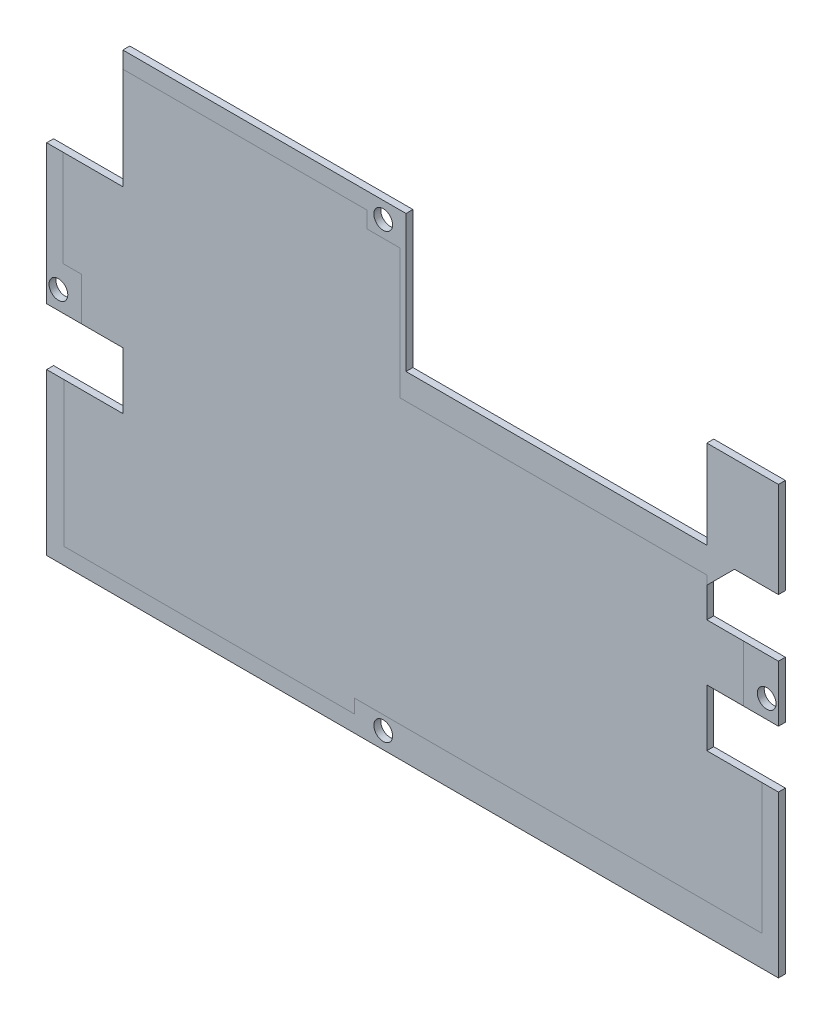
ISO-10303-21;
HEADER;
FILE_DESCRIPTION(('STEP AP214'),'2;1');
FILE_NAME('part.step','',(''),(''),'','','');
FILE_SCHEMA(('AUTOMOTIVE_DESIGN { 1 0 10303 214 1 1 1 1 }'));
ENDSEC;
DATA;
#1=APPLICATION_CONTEXT('core data for automotive mechanical design processes');
#2=APPLICATION_PROTOCOL_DEFINITION('international standard','automotive_design',2000,#1);
#3=PRODUCT_CONTEXT('',#1,'mechanical');
#4=PRODUCT('Part','Part','',(#3));
#5=PRODUCT_RELATED_PRODUCT_CATEGORY('part','',(#4));
#6=PRODUCT_DEFINITION_FORMATION('','',#4);
#7=PRODUCT_DEFINITION_CONTEXT('part definition',#1,'design');
#8=PRODUCT_DEFINITION('design','',#6,#7);
#9=PRODUCT_DEFINITION_SHAPE('','',#8);
#10=(LENGTH_UNIT() NAMED_UNIT(*) SI_UNIT(.MILLI.,.METRE.));
#11=(NAMED_UNIT(*) PLANE_ANGLE_UNIT() SI_UNIT($,.RADIAN.));
#12=(NAMED_UNIT(*) SI_UNIT($,.STERADIAN.) SOLID_ANGLE_UNIT());
#13=UNCERTAINTY_MEASURE_WITH_UNIT(LENGTH_MEASURE(1.E-05),#10,'distance_accuracy_value','');
#14=(GEOMETRIC_REPRESENTATION_CONTEXT(3) GLOBAL_UNCERTAINTY_ASSIGNED_CONTEXT((#13)) GLOBAL_UNIT_ASSIGNED_CONTEXT((#10,
#11,#12)) REPRESENTATION_CONTEXT('',''));
#15=CARTESIAN_POINT('',(0.,0.,0.));
#16=DIRECTION('',(0.,0.,1.));
#17=DIRECTION('',(1.,0.,0.));
#18=AXIS2_PLACEMENT_3D('',#15,#16,#17);
#19=CARTESIAN_POINT('',(0.,2.77555756156289E-13,1.58750000000001));
#20=DIRECTION('',(0.,0.,1.));
#21=DIRECTION('',(1.,0.,0.));
#22=AXIS2_PLACEMENT_3D('',#19,#20,#21);
#23=PLANE('',#22);
#24=CARTESIAN_POINT('',(-56.162,-40.8939999999999,1.58750000000001));
#25=DIRECTION('',(0.,0.,-1.));
#26=DIRECTION('',(-1.,0.,0.));
#27=AXIS2_PLACEMENT_3D('',#24,#25,#26);
#28=CIRCLE('',#27,2.15265);
#29=CARTESIAN_POINT('',(-58.31465,-40.8939999999999,1.58750000000001));
#30=VERTEX_POINT('',#29);
#31=EDGE_CURVE('E570',#30,#30,#28,.T.);
#32=ORIENTED_EDGE('',*,*,#31,.T.);
#33=EDGE_LOOP('',(#32));
#34=FACE_BOUND('',#33,.T.);
#35=DIRECTION('',(-1.,0.,0.));
#36=VECTOR('',#35,1.);
#37=CARTESIAN_POINT('',(0.,-35.2241419424065,1.58750000000001));
#38=LINE('',#37,#36);
#39=CARTESIAN_POINT('',(-50.8980756529792,-35.2241419424065,1.58750000000001));
#40=VERTEX_POINT('',#39);
#41=CARTESIAN_POINT('',(-55.1232721065638,-35.2241419424065,1.58750000000001));
#42=VERTEX_POINT('',#41);
#43=EDGE_CURVE('E47',#40,#42,#38,.T.);
#44=ORIENTED_EDGE('',*,*,#43,.T.);
#45=DIRECTION('',(0.,1.,0.));
#46=VECTOR('',#45,1.);
#47=CARTESIAN_POINT('',(-55.1232721065638,3.05311331771918E-13,1.58750000000001));
#48=LINE('',#47,#46);
#49=CARTESIAN_POINT('',(-55.1232721065638,-13.0804999999998,1.58749999999987));
#50=VERTEX_POINT('',#49);
#51=EDGE_CURVE('E11',#42,#50,#48,.T.);
#52=ORIENTED_EDGE('',*,*,#51,.T.);
#53=DIRECTION('',(1.,0.,0.));
#54=VECTOR('',#53,1.);
#55=CARTESIAN_POINT('',(-58.86075,-13.0804999999998,1.58749999999987));
#56=LINE('',#55,#54);
#57=CARTESIAN_POINT('',(-58.86075,-13.0804999999998,1.58749999999987));
#58=VERTEX_POINT('',#57);
#59=EDGE_CURVE('E253',#58,#50,#56,.T.);
#60=ORIENTED_EDGE('',*,*,#59,.F.);
#61=DIRECTION('',(0.,-1.,0.));
#62=VECTOR('',#61,1.);
#63=CARTESIAN_POINT('',(-58.86075,-13.0804999999998,1.58749999999987));
#64=LINE('',#63,#62);
#65=CARTESIAN_POINT('',(-58.86075,-45.0854999999999,1.58749999999997));
#66=VERTEX_POINT('',#65);
#67=EDGE_CURVE('E340',#58,#66,#64,.T.);
#68=ORIENTED_EDGE('',*,*,#67,.T.);
#69=DIRECTION('',(1.,0.,0.));
#70=VECTOR('',#69,1.);
#71=CARTESIAN_POINT('',(-58.86075,-45.0854999999999,1.58749999999997));
#72=LINE('',#71,#70);
#73=CARTESIAN_POINT('',(-50.8980756529792,-45.0854999999999,1.58749999999997));
#74=VERTEX_POINT('',#73);
#75=EDGE_CURVE('E330',#66,#74,#72,.T.);
#76=ORIENTED_EDGE('',*,*,#75,.T.);
#77=DIRECTION('',(0.,1.,0.));
#78=VECTOR('',#77,1.);
#79=CARTESIAN_POINT('',(-50.8980756529792,2.77555756156289E-13,1.58750000000001));
#80=LINE('',#79,#78);
#81=EDGE_CURVE('E322',#74,#40,#80,.T.);
#82=ORIENTED_EDGE('',*,*,#81,.T.);
#83=EDGE_LOOP('',(#44,#52,#60,#68,#76,#82));
#84=FACE_BOUND('',#83,.T.);
#85=ADVANCED_FACE('F38',(#34,#84),#23,.T.);
#86=CARTESIAN_POINT('',(18.387,-91.3129999999999,1.58750000000001));
#87=DIRECTION('',(0.,0.,-1.));
#88=DIRECTION('',(-1.,0.,0.));
#89=AXIS2_PLACEMENT_3D('',#86,#87,#88);
#90=CIRCLE('',#89,2.15265);
#91=CARTESIAN_POINT('',(16.23435,-91.3129999999999,1.58750000000001));
#92=VERTEX_POINT('',#91);
#93=EDGE_CURVE('E404',#92,#92,#90,.T.);
#94=ORIENTED_EDGE('',*,*,#93,.T.);
#95=EDGE_LOOP('',(#94));
#96=FACE_BOUND('',#95,.T.);
#97=DIRECTION('',(-1.,0.,0.));
#98=VECTOR('',#97,1.);
#99=CARTESIAN_POINT('',(0.,-91.3130000000001,1.58750000000001));
#100=LINE('',#99,#98);
#101=CARTESIAN_POINT('',(11.78935,-91.3130000000001,1.58750000000001));
#102=VERTEX_POINT('',#101);
#103=CARTESIAN_POINT('',(-54.9021052088237,-91.3130000000001,1.58750000000001));
#104=VERTEX_POINT('',#103);
#105=EDGE_CURVE('E315',#102,#104,#100,.T.);
#106=ORIENTED_EDGE('',*,*,#105,.T.);
#107=DIRECTION('',(0.,1.,0.));
#108=VECTOR('',#107,1.);
#109=CARTESIAN_POINT('',(-54.9021052088237,2.77555756156289E-13,1.58750000000001));
#110=LINE('',#109,#108);
#111=CARTESIAN_POINT('',(-54.9021052088237,-58.1654999999999,1.58749999999993));
#112=VERTEX_POINT('',#111);
#113=EDGE_CURVE('E319',#104,#112,#110,.T.);
#114=ORIENTED_EDGE('',*,*,#113,.T.);
#115=DIRECTION('',(-1.,0.,0.));
#116=VECTOR('',#115,1.);
#117=CARTESIAN_POINT('',(-41.367,-58.1654999999999,1.58749999999993));
#118=LINE('',#117,#116);
#119=CARTESIAN_POINT('',(-58.8607499999999,-58.1654999999999,1.58749999999993));
#120=VERTEX_POINT('',#119);
#121=EDGE_CURVE('E346',#112,#120,#118,.T.);
#122=ORIENTED_EDGE('',*,*,#121,.T.);
#123=DIRECTION('',(0.,1.,0.));
#124=VECTOR('',#123,1.);
#125=CARTESIAN_POINT('',(-58.8607499999999,-95.1229999999999,1.58749999999999));
#126=LINE('',#125,#124);
#127=CARTESIAN_POINT('',(-58.8607499999999,-95.1229999999999,1.58749999999999));
#128=VERTEX_POINT('',#127);
#129=EDGE_CURVE('E350',#128,#120,#126,.T.);
#130=ORIENTED_EDGE('',*,*,#129,.F.);
#131=DIRECTION('',(-1.,0.,0.));
#132=VECTOR('',#131,1.);
#133=CARTESIAN_POINT('',(-38.0289667682287,-95.1229999999999,1.58749999999999));
#134=LINE('',#133,#132);
#135=CARTESIAN_POINT('',(109.09675,-95.1229999999999,1.58749999999999));
#136=VERTEX_POINT('',#135);
#137=EDGE_CURVE('E353',#136,#128,#134,.T.);
#138=ORIENTED_EDGE('',*,*,#137,.F.);
#139=DIRECTION('',(0.,1.,0.));
#140=VECTOR('',#139,1.);
#141=CARTESIAN_POINT('',(109.09675,-95.1229999999999,1.58749999999999));
#142=LINE('',#141,#140);
#143=CARTESIAN_POINT('',(109.09675,-58.1654999999996,1.58749999999993));
#144=VERTEX_POINT('',#143);
#145=EDGE_CURVE('E356',#136,#144,#142,.T.);
#146=ORIENTED_EDGE('',*,*,#145,.T.);
#147=DIRECTION('',(1.,0.,0.));
#148=VECTOR('',#147,1.);
#149=CARTESIAN_POINT('',(92.658,-58.1654999999996,1.58749999999993));
#150=LINE('',#149,#148);
#151=CARTESIAN_POINT('',(105.324493125114,-58.1654999999996,1.58749999999993));
#152=VERTEX_POINT('',#151);
#153=EDGE_CURVE('E359',#152,#144,#150,.T.);
#154=ORIENTED_EDGE('',*,*,#153,.F.);
#155=DIRECTION('',(-0.00125925749234109,-0.99999920713497,0.));
#156=VECTOR('',#155,1.);
#157=CARTESIAN_POINT('',(105.397571392563,-0.132722786681611,1.58750000000001));
#158=LINE('',#157,#156);
#159=CARTESIAN_POINT('',(105.28675,-88.1380000000001,1.58750000000001));
#160=VERTEX_POINT('',#159);
#161=EDGE_CURVE('E303',#152,#160,#158,.T.);
#162=ORIENTED_EDGE('',*,*,#161,.T.);
#163=DIRECTION('',(-1.,0.,0.));
#164=VECTOR('',#163,1.);
#165=CARTESIAN_POINT('',(0.,-88.138,1.58750000000001));
#166=LINE('',#165,#164);
#167=CARTESIAN_POINT('',(11.78935,-88.138,1.58750000000001));
#168=VERTEX_POINT('',#167);
#169=EDGE_CURVE('E307',#160,#168,#166,.T.);
#170=ORIENTED_EDGE('',*,*,#169,.T.);
#171=DIRECTION('',(0.,-1.,0.));
#172=VECTOR('',#171,1.);
#173=CARTESIAN_POINT('',(11.7893499999999,2.77555756156289E-13,1.58750000000001));
#174=LINE('',#173,#172);
#175=EDGE_CURVE('E311',#168,#102,#174,.T.);
#176=ORIENTED_EDGE('',*,*,#175,.T.);
#177=EDGE_LOOP('',(#106,#114,#122,#130,#138,#146,#154,#162,#170,#176));
#178=FACE_BOUND('',#177,.T.);
#179=ADVANCED_FACE('F523',(#96,#178),#23,.T.);
#180=CARTESIAN_POINT('',(106.398,-40.8939999999999,1.58750000000001));
#181=DIRECTION('',(0.,0.,-1.));
#182=DIRECTION('',(-1.,0.,0.));
#183=AXIS2_PLACEMENT_3D('',#180,#181,#182);
#184=CIRCLE('',#183,2.15264999999999);
#185=CARTESIAN_POINT('',(104.24535,-40.8939999999999,1.58750000000001));
#186=VERTEX_POINT('',#185);
#187=EDGE_CURVE('E582',#186,#186,#184,.T.);
#188=ORIENTED_EDGE('',*,*,#187,.T.);
#189=EDGE_LOOP('',(#188));
#190=FACE_BOUND('',#189,.T.);
#191=DIRECTION('',(0.,-1.,0.));
#192=VECTOR('',#191,1.);
#193=CARTESIAN_POINT('',(101.059888188257,2.77555756156289E-13,1.58750000000001));
#194=LINE('',#193,#192);
#195=CARTESIAN_POINT('',(101.059888188257,-32.150898303399,1.58749999999999));
#196=VERTEX_POINT('',#195);
#197=CARTESIAN_POINT('',(101.059888188257,-45.0384607081338,1.58749999999999));
#198=VERTEX_POINT('',#197);
#199=EDGE_CURVE('E296',#196,#198,#194,.T.);
#200=ORIENTED_EDGE('',*,*,#199,.T.);
#201=DIRECTION('',(-0.999984327887164,-0.00559856946518869,0.));
#202=VECTOR('',#201,1.);
#203=CARTESIAN_POINT('',(0.255314618261396,-45.6028309605485,1.58750000000001));
#204=LINE('',#203,#202);
#205=CARTESIAN_POINT('',(92.658,-45.0854999999996,1.58749999999997));
#206=VERTEX_POINT('',#205);
#207=EDGE_CURVE('E300',#198,#206,#204,.T.);
#208=ORIENTED_EDGE('',*,*,#207,.T.);
#209=DIRECTION('',(1.,0.,0.));
#210=VECTOR('',#209,1.);
#211=CARTESIAN_POINT('',(92.658,-45.0854999999996,1.58749999999997));
#212=LINE('',#211,#210);
#213=CARTESIAN_POINT('',(109.09675,-45.0854999999996,1.58749999999997));
#214=VERTEX_POINT('',#213);
#215=EDGE_CURVE('E366',#206,#214,#212,.T.);
#216=ORIENTED_EDGE('',*,*,#215,.T.);
#217=DIRECTION('',(0.,-1.,0.));
#218=VECTOR('',#217,1.);
#219=CARTESIAN_POINT('',(109.09675,-32.150898303399,1.58749999999999));
#220=LINE('',#219,#218);
#221=CARTESIAN_POINT('',(109.09675,-32.150898303399,1.58749999999999));
#222=VERTEX_POINT('',#221);
#223=EDGE_CURVE('E368',#222,#214,#220,.T.);
#224=ORIENTED_EDGE('',*,*,#223,.F.);
#225=DIRECTION('',(1.,0.,0.));
#226=VECTOR('',#225,1.);
#227=CARTESIAN_POINT('',(92.658,-32.150898303399,1.58749999999999));
#228=LINE('',#227,#226);
#229=EDGE_CURVE('E371',#196,#222,#228,.T.);
#230=ORIENTED_EDGE('',*,*,#229,.F.);
#231=EDGE_LOOP('',(#200,#208,#216,#224,#230));
#232=FACE_BOUND('',#231,.T.);
#233=ADVANCED_FACE('F543',(#190,#232),#23,.T.);
#234=CARTESIAN_POINT('',(18.387,10.2870000000002,1.58749999999987));
#235=DIRECTION('',(0.,0.,-1.));
#236=DIRECTION('',(-1.,0.,0.));
#237=AXIS2_PLACEMENT_3D('',#234,#235,#236);
#238=CIRCLE('',#237,2.15265);
#239=CARTESIAN_POINT('',(16.23435,10.2870000000002,1.58749999999987));
#240=VERTEX_POINT('',#239);
#241=EDGE_CURVE('E576',#240,#240,#238,.T.);
#242=ORIENTED_EDGE('',*,*,#241,.T.);
#243=EDGE_LOOP('',(#242));
#244=FACE_BOUND('',#243,.T.);
#245=DIRECTION('',(1.,0.,0.));
#246=VECTOR('',#245,1.);
#247=CARTESIAN_POINT('',(0.,-23.2430024525534,1.58750000000001));
#248=LINE('',#247,#246);
#249=CARTESIAN_POINT('',(22.276438833382,-23.2430024525534,1.58750000000001));
#250=VERTEX_POINT('',#249);
#251=CARTESIAN_POINT('',(92.7226000847606,-23.2430024525534,1.58750000000001));
#252=VERTEX_POINT('',#251);
#253=EDGE_CURVE('E289',#250,#252,#248,.T.);
#254=ORIENTED_EDGE('',*,*,#253,.T.);
#255=DIRECTION('',(-0.00725181201039535,-0.999973705265577,0.));
#256=VECTOR('',#255,1.);
#257=CARTESIAN_POINT('',(92.8862733688451,-0.673611505252414,1.58750000000001));
#258=LINE('',#257,#256);
#259=CARTESIAN_POINT('',(92.7082428987028,-25.2227571012969,1.58750000000001));
#260=VERTEX_POINT('',#259);
#261=EDGE_CURVE('E293',#252,#260,#258,.T.);
#262=ORIENTED_EDGE('',*,*,#261,.T.);
#263=DIRECTION('',(-0.707106781186551,-0.707106781186544,0.));
#264=VECTOR('',#263,1.);
#265=CARTESIAN_POINT('',(99.008,-18.9229999999997,1.58750000000001));
#266=LINE('',#265,#264);
#267=CARTESIAN_POINT('',(99.008,-18.9229999999997,1.58750000000001));
#268=VERTEX_POINT('',#267);
#269=EDGE_CURVE('E379',#268,#260,#266,.T.);
#270=ORIENTED_EDGE('',*,*,#269,.F.);
#271=DIRECTION('',(1.,0.,0.));
#272=VECTOR('',#271,1.);
#273=CARTESIAN_POINT('',(99.008,-18.9229999999997,1.58750000000001));
#274=LINE('',#273,#272);
#275=CARTESIAN_POINT('',(109.09675,-18.9229999999997,1.58750000000001));
#276=VERTEX_POINT('',#275);
#277=EDGE_CURVE('E382',#268,#276,#274,.T.);
#278=ORIENTED_EDGE('',*,*,#277,.T.);
#279=DIRECTION('',(0.,1.,0.));
#280=VECTOR('',#279,1.);
#281=CARTESIAN_POINT('',(109.09675,-18.9229999999997,1.58750000000001));
#282=LINE('',#281,#280);
#283=CARTESIAN_POINT('',(109.09675,2.9845000000005,1.58750000000001));
#284=VERTEX_POINT('',#283);
#285=EDGE_CURVE('E384',#276,#284,#282,.T.);
#286=ORIENTED_EDGE('',*,*,#285,.T.);
#287=DIRECTION('',(1.,0.,0.));
#288=VECTOR('',#287,1.);
#289=CARTESIAN_POINT('',(92.658,2.9845000000005,1.58750000000001));
#290=LINE('',#289,#288);
#291=CARTESIAN_POINT('',(92.658,2.9845000000005,1.58750000000001));
#292=VERTEX_POINT('',#291);
#293=EDGE_CURVE('E386',#292,#284,#290,.T.);
#294=ORIENTED_EDGE('',*,*,#293,.F.);
#295=DIRECTION('',(0.,1.,0.));
#296=VECTOR('',#295,1.);
#297=CARTESIAN_POINT('',(92.658,-17.3199999999997,1.58749999999999));
#298=LINE('',#297,#296);
#299=CARTESIAN_POINT('',(92.658,-17.3199999999997,1.58749999999999));
#300=VERTEX_POINT('',#299);
#301=EDGE_CURVE('E389',#300,#292,#298,.T.);
#302=ORIENTED_EDGE('',*,*,#301,.F.);
#303=DIRECTION('',(1.,0.,0.));
#304=VECTOR('',#303,1.);
#305=CARTESIAN_POINT('',(23.6180000000001,-17.3199999999997,1.58749999999999));
#306=LINE('',#305,#304);
#307=CARTESIAN_POINT('',(23.6180000000001,-17.3199999999997,1.58749999999999));
#308=VERTEX_POINT('',#307);
#309=EDGE_CURVE('E392',#308,#300,#306,.T.);
#310=ORIENTED_EDGE('',*,*,#309,.F.);
#311=DIRECTION('',(0.,-1.,0.));
#312=VECTOR('',#311,1.);
#313=CARTESIAN_POINT('',(23.618,14.0970000000002,1.58749999999999));
#314=LINE('',#313,#312);
#315=CARTESIAN_POINT('',(23.618,14.0970000000002,1.58749999999999));
#316=VERTEX_POINT('',#315);
#317=EDGE_CURVE('E395',#316,#308,#314,.T.);
#318=ORIENTED_EDGE('',*,*,#317,.F.);
#319=DIRECTION('',(1.,0.,0.));
#320=VECTOR('',#319,1.);
#321=CARTESIAN_POINT('',(6.66343681530298,14.0970000000002,1.58749999999999));
#322=LINE('',#321,#320);
#323=CARTESIAN_POINT('',(-41.367,14.0970000000002,1.58749999999999));
#324=VERTEX_POINT('',#323);
#325=EDGE_CURVE('E398',#324,#316,#322,.T.);
#326=ORIENTED_EDGE('',*,*,#325,.F.);
#327=DIRECTION('',(0.,-1.,0.));
#328=VECTOR('',#327,1.);
#329=CARTESIAN_POINT('',(-41.367,14.0970000000002,1.58749999999999));
#330=LINE('',#329,#328);
#331=CARTESIAN_POINT('',(-41.367,10.287,1.58749999999996));
#332=VERTEX_POINT('',#331);
#333=EDGE_CURVE('E254',#324,#332,#330,.T.);
#334=ORIENTED_EDGE('',*,*,#333,.T.);
#335=DIRECTION('',(1.,0.,0.));
#336=VECTOR('',#335,1.);
#337=CARTESIAN_POINT('',(0.,10.287,1.58749999999998));
#338=LINE('',#337,#336);
#339=CARTESIAN_POINT('',(14.6198067374962,10.287,1.58749999999998));
#340=VERTEX_POINT('',#339);
#341=EDGE_CURVE('E260',#332,#340,#338,.T.);
#342=ORIENTED_EDGE('',*,*,#341,.T.);
#343=DIRECTION('',(0.,-1.,0.));
#344=VECTOR('',#343,1.);
#345=CARTESIAN_POINT('',(14.6198067374962,2.77555756156289E-13,1.58750000000001));
#346=LINE('',#345,#344);
#347=CARTESIAN_POINT('',(14.6198067374962,6.54685000000002,1.5875));
#348=VERTEX_POINT('',#347);
#349=EDGE_CURVE('E272',#340,#348,#346,.T.);
#350=ORIENTED_EDGE('',*,*,#349,.T.);
#351=DIRECTION('',(1.,0.,0.));
#352=VECTOR('',#351,1.);
#353=CARTESIAN_POINT('',(0.,6.54685000000002,1.5875));
#354=LINE('',#353,#352);
#355=CARTESIAN_POINT('',(22.276438833382,6.54685000000002,1.5875));
#356=VERTEX_POINT('',#355);
#357=EDGE_CURVE('E281',#348,#356,#354,.T.);
#358=ORIENTED_EDGE('',*,*,#357,.T.);
#359=DIRECTION('',(0.,-1.,0.));
#360=VECTOR('',#359,1.);
#361=CARTESIAN_POINT('',(22.276438833382,2.77555756156289E-13,1.58750000000001));
#362=LINE('',#361,#360);
#363=EDGE_CURVE('E285',#356,#250,#362,.T.);
#364=ORIENTED_EDGE('',*,*,#363,.T.);
#365=EDGE_LOOP('',(#254,#262,#270,#278,#286,#294,#302,#310,#318,#326,#334,#342,#350,#358,#364));
#366=FACE_BOUND('',#365,.T.);
#367=ADVANCED_FACE('F561',(#244,#366),#23,.T.);
#368=CARTESIAN_POINT('',(0.,0.,0.));
#369=DIRECTION('',(0.,0.,1.));
#370=DIRECTION('',(1.,0.,0.));
#371=AXIS2_PLACEMENT_3D('',#368,#369,#370);
#372=PLANE('',#371);
#373=CARTESIAN_POINT('',(106.398,-40.8939999999999,0.));
#374=DIRECTION('',(0.,0.,-1.));
#375=DIRECTION('',(-1.,0.,0.));
#376=AXIS2_PLACEMENT_3D('',#373,#374,#375);
#377=CIRCLE('',#376,2.15264999999999);
#378=CARTESIAN_POINT('',(104.24535,-40.8939999999999,0.));
#379=VERTEX_POINT('',#378);
#380=EDGE_CURVE('E585',#379,#379,#377,.T.);
#381=ORIENTED_EDGE('',*,*,#380,.F.);
#382=EDGE_LOOP('',(#381));
#383=FACE_BOUND('',#382,.T.);
#384=CARTESIAN_POINT('',(18.387,10.287,-1.38777878078145E-13));
#385=DIRECTION('',(0.,0.,-1.));
#386=DIRECTION('',(-1.,0.,0.));
#387=AXIS2_PLACEMENT_3D('',#384,#385,#386);
#388=CIRCLE('',#387,2.15264999999999);
#389=CARTESIAN_POINT('',(16.23435,10.287,-1.38777878078145E-13));
#390=VERTEX_POINT('',#389);
#391=EDGE_CURVE('E579',#390,#390,#388,.T.);
#392=ORIENTED_EDGE('',*,*,#391,.F.);
#393=EDGE_LOOP('',(#392));
#394=FACE_BOUND('',#393,.T.);
#395=CARTESIAN_POINT('',(-56.162,-40.8939999999999,0.));
#396=DIRECTION('',(0.,0.,-1.));
#397=DIRECTION('',(-1.,0.,0.));
#398=AXIS2_PLACEMENT_3D('',#395,#396,#397);
#399=CIRCLE('',#398,2.15264999999999);
#400=CARTESIAN_POINT('',(-58.31465,-40.8939999999999,0.));
#401=VERTEX_POINT('',#400);
#402=EDGE_CURVE('E573',#401,#401,#399,.T.);
#403=ORIENTED_EDGE('',*,*,#402,.F.);
#404=EDGE_LOOP('',(#403));
#405=FACE_BOUND('',#404,.T.);
#406=DIRECTION('',(0.,-1.,0.));
#407=VECTOR('',#406,1.);
#408=CARTESIAN_POINT('',(-41.367,14.097,0.));
#409=LINE('',#408,#407);
#410=CARTESIAN_POINT('',(-41.367,14.097,0.));
#411=VERTEX_POINT('',#410);
#412=CARTESIAN_POINT('',(-41.367,-13.0805000000001,-1.38777878078145E-13));
#413=VERTEX_POINT('',#412);
#414=EDGE_CURVE('E267',#411,#413,#409,.T.);
#415=ORIENTED_EDGE('',*,*,#414,.F.);
#416=DIRECTION('',(1.,0.,0.));
#417=VECTOR('',#416,1.);
#418=CARTESIAN_POINT('',(-41.367,14.097,0.));
#419=LINE('',#418,#417);
#420=CARTESIAN_POINT('',(23.618,14.097,0.));
#421=VERTEX_POINT('',#420);
#422=EDGE_CURVE('E264',#411,#421,#419,.T.);
#423=ORIENTED_EDGE('',*,*,#422,.T.);
#424=DIRECTION('',(0.,-1.,0.));
#425=VECTOR('',#424,1.);
#426=CARTESIAN_POINT('',(23.618,14.097,0.));
#427=LINE('',#426,#425);
#428=CARTESIAN_POINT('',(23.6180000000001,-17.32,0.));
#429=VERTEX_POINT('',#428);
#430=EDGE_CURVE('E457',#421,#429,#427,.T.);
#431=ORIENTED_EDGE('',*,*,#430,.T.);
#432=DIRECTION('',(1.,0.,0.));
#433=VECTOR('',#432,1.);
#434=CARTESIAN_POINT('',(23.6180000000001,-17.32,0.));
#435=LINE('',#434,#433);
#436=CARTESIAN_POINT('',(92.658,-17.32,0.));
#437=VERTEX_POINT('',#436);
#438=EDGE_CURVE('E454',#429,#437,#435,.T.);
#439=ORIENTED_EDGE('',*,*,#438,.T.);
#440=DIRECTION('',(0.,1.,0.));
#441=VECTOR('',#440,1.);
#442=CARTESIAN_POINT('',(92.658,-17.32,0.));
#443=LINE('',#442,#441);
#444=CARTESIAN_POINT('',(92.658,2.98450000000022,0.));
#445=VERTEX_POINT('',#444);
#446=EDGE_CURVE('E451',#437,#445,#443,.T.);
#447=ORIENTED_EDGE('',*,*,#446,.T.);
#448=DIRECTION('',(1.,0.,0.));
#449=VECTOR('',#448,1.);
#450=CARTESIAN_POINT('',(92.658,2.98450000000022,0.));
#451=LINE('',#450,#449);
#452=CARTESIAN_POINT('',(109.09675,2.98450000000022,0.));
#453=VERTEX_POINT('',#452);
#454=EDGE_CURVE('E448',#445,#453,#451,.T.);
#455=ORIENTED_EDGE('',*,*,#454,.T.);
#456=DIRECTION('',(0.,1.,0.));
#457=VECTOR('',#456,1.);
#458=CARTESIAN_POINT('',(109.09675,-18.923,0.));
#459=LINE('',#458,#457);
#460=CARTESIAN_POINT('',(109.09675,-18.923,0.));
#461=VERTEX_POINT('',#460);
#462=EDGE_CURVE('E445',#461,#453,#459,.T.);
#463=ORIENTED_EDGE('',*,*,#462,.F.);
#464=DIRECTION('',(1.,0.,0.));
#465=VECTOR('',#464,1.);
#466=CARTESIAN_POINT('',(99.008,-18.923,0.));
#467=LINE('',#466,#465);
#468=CARTESIAN_POINT('',(99.008,-18.923,0.));
#469=VERTEX_POINT('',#468);
#470=EDGE_CURVE('E443',#469,#461,#467,.T.);
#471=ORIENTED_EDGE('',*,*,#470,.F.);
#472=DIRECTION('',(-0.707106781186551,-0.707106781186544,0.));
#473=VECTOR('',#472,1.);
#474=CARTESIAN_POINT('',(99.008,-18.923,0.));
#475=LINE('',#474,#473);
#476=CARTESIAN_POINT('',(92.658,-25.2729999999999,0.));
#477=VERTEX_POINT('',#476);
#478=EDGE_CURVE('E440',#469,#477,#475,.T.);
#479=ORIENTED_EDGE('',*,*,#478,.T.);
#480=DIRECTION('',(0.,1.,0.));
#481=VECTOR('',#480,1.);
#482=CARTESIAN_POINT('',(92.658,-32.1508983033992,0.));
#483=LINE('',#482,#481);
#484=CARTESIAN_POINT('',(92.658,-32.1508983033992,0.));
#485=VERTEX_POINT('',#484);
#486=EDGE_CURVE('E437',#485,#477,#483,.T.);
#487=ORIENTED_EDGE('',*,*,#486,.F.);
#488=DIRECTION('',(1.,0.,0.));
#489=VECTOR('',#488,1.);
#490=CARTESIAN_POINT('',(92.658,-32.1508983033992,0.));
#491=LINE('',#490,#489);
#492=CARTESIAN_POINT('',(109.09675,-32.1508983033992,0.));
#493=VERTEX_POINT('',#492);
#494=EDGE_CURVE('E434',#485,#493,#491,.T.);
#495=ORIENTED_EDGE('',*,*,#494,.T.);
#496=DIRECTION('',(0.,-1.,0.));
#497=VECTOR('',#496,1.);
#498=CARTESIAN_POINT('',(109.09675,-32.1508983033992,0.));
#499=LINE('',#498,#497);
#500=CARTESIAN_POINT('',(109.09675,-45.0854999999996,0.));
#501=VERTEX_POINT('',#500);
#502=EDGE_CURVE('E431',#493,#501,#499,.T.);
#503=ORIENTED_EDGE('',*,*,#502,.T.);
#504=DIRECTION('',(1.,0.,0.));
#505=VECTOR('',#504,1.);
#506=CARTESIAN_POINT('',(92.658,-45.0854999999996,0.));
#507=LINE('',#506,#505);
#508=CARTESIAN_POINT('',(92.658,-45.0854999999996,0.));
#509=VERTEX_POINT('',#508);
#510=EDGE_CURVE('E428',#509,#501,#507,.T.);
#511=ORIENTED_EDGE('',*,*,#510,.F.);
#512=DIRECTION('',(0.,1.,0.));
#513=VECTOR('',#512,1.);
#514=CARTESIAN_POINT('',(92.658,-58.1654999999996,0.));
#515=LINE('',#514,#513);
#516=CARTESIAN_POINT('',(92.658,-58.1654999999996,0.));
#517=VERTEX_POINT('',#516);
#518=EDGE_CURVE('E426',#517,#509,#515,.T.);
#519=ORIENTED_EDGE('',*,*,#518,.F.);
#520=DIRECTION('',(1.,0.,0.));
#521=VECTOR('',#520,1.);
#522=CARTESIAN_POINT('',(92.658,-58.1654999999996,0.));
#523=LINE('',#522,#521);
#524=CARTESIAN_POINT('',(109.09675,-58.1654999999996,0.));
#525=VERTEX_POINT('',#524);
#526=EDGE_CURVE('E423',#517,#525,#523,.T.);
#527=ORIENTED_EDGE('',*,*,#526,.T.);
#528=DIRECTION('',(0.,1.,0.));
#529=VECTOR('',#528,1.);
#530=CARTESIAN_POINT('',(109.09675,-95.1229999999999,0.));
#531=LINE('',#530,#529);
#532=CARTESIAN_POINT('',(109.09675,-95.1229999999999,0.));
#533=VERTEX_POINT('',#532);
#534=EDGE_CURVE('E420',#533,#525,#531,.T.);
#535=ORIENTED_EDGE('',*,*,#534,.F.);
#536=DIRECTION('',(1.,0.,0.));
#537=VECTOR('',#536,1.);
#538=CARTESIAN_POINT('',(90.082920322889,-95.1229999999999,0.));
#539=LINE('',#538,#537);
#540=CARTESIAN_POINT('',(-58.8607499999999,-95.1229999999999,0.));
#541=VERTEX_POINT('',#540);
#542=EDGE_CURVE('E418',#541,#533,#539,.T.);
#543=ORIENTED_EDGE('',*,*,#542,.F.);
#544=DIRECTION('',(0.,1.,0.));
#545=VECTOR('',#544,1.);
#546=CARTESIAN_POINT('',(-58.8607499999999,-95.1229999999999,0.));
#547=LINE('',#546,#545);
#548=CARTESIAN_POINT('',(-58.8607499999999,-58.1654999999999,0.));
#549=VERTEX_POINT('',#548);
#550=EDGE_CURVE('E415',#541,#549,#547,.T.);
#551=ORIENTED_EDGE('',*,*,#550,.T.);
#552=DIRECTION('',(-1.,0.,0.));
#553=VECTOR('',#552,1.);
#554=CARTESIAN_POINT('',(-41.367,-58.1654999999999,0.));
#555=LINE('',#554,#553);
#556=CARTESIAN_POINT('',(-41.367,-58.1654999999999,0.));
#557=VERTEX_POINT('',#556);
#558=EDGE_CURVE('E412',#557,#549,#555,.T.);
#559=ORIENTED_EDGE('',*,*,#558,.F.);
#560=DIRECTION('',(0.,-1.,0.));
#561=VECTOR('',#560,1.);
#562=CARTESIAN_POINT('',(-41.367,-45.0854999999999,0.));
#563=LINE('',#562,#561);
#564=CARTESIAN_POINT('',(-41.367,-45.0854999999999,0.));
#565=VERTEX_POINT('',#564);
#566=EDGE_CURVE('E410',#565,#557,#563,.T.);
#567=ORIENTED_EDGE('',*,*,#566,.F.);
#568=DIRECTION('',(1.,0.,0.));
#569=VECTOR('',#568,1.);
#570=CARTESIAN_POINT('',(-58.86075,-45.0854999999999,0.));
#571=LINE('',#570,#569);
#572=CARTESIAN_POINT('',(-58.86075,-45.0854999999999,0.));
#573=VERTEX_POINT('',#572);
#574=EDGE_CURVE('E408',#573,#565,#571,.T.);
#575=ORIENTED_EDGE('',*,*,#574,.F.);
#576=DIRECTION('',(0.,-1.,0.));
#577=VECTOR('',#576,1.);
#578=CARTESIAN_POINT('',(-58.86075,-13.0805000000001,-1.38777878078145E-13));
#579=LINE('',#578,#577);
#580=CARTESIAN_POINT('',(-58.86075,-13.0805000000001,-1.38777878078145E-13));
#581=VERTEX_POINT('',#580);
#582=EDGE_CURVE('E406',#581,#573,#579,.T.);
#583=ORIENTED_EDGE('',*,*,#582,.F.);
#584=DIRECTION('',(1.,0.,0.));
#585=VECTOR('',#584,1.);
#586=CARTESIAN_POINT('',(-58.86075,-13.0805000000001,-1.38777878078145E-13));
#587=LINE('',#586,#585);
#588=EDGE_CURVE('E403',#581,#413,#587,.T.);
#589=ORIENTED_EDGE('',*,*,#588,.T.);
#590=EDGE_LOOP('',(#415,#423,#431,#439,#447,#455,#463,#471,#479,#487,#495,#503,#511,#519,#527,
#535,#543,#551,#559,#567,#575,#583,#589));
#591=FACE_BOUND('',#590,.T.);
#592=CARTESIAN_POINT('',(18.387,-91.3129999999999,0.));
#593=DIRECTION('',(0.,0.,-1.));
#594=DIRECTION('',(-1.,0.,0.));
#595=AXIS2_PLACEMENT_3D('',#592,#593,#594);
#596=CIRCLE('',#595,2.15264999999999);
#597=CARTESIAN_POINT('',(16.23435,-91.3129999999999,0.));
#598=VERTEX_POINT('',#597);
#599=EDGE_CURVE('E567',#598,#598,#596,.T.);
#600=ORIENTED_EDGE('',*,*,#599,.F.);
#601=EDGE_LOOP('',(#600));
#602=FACE_BOUND('',#601,.T.);
#603=ADVANCED_FACE('F511',(#383,#394,#405,#591,#602),#372,.F.);
#604=CARTESIAN_POINT('',(-41.367,14.0970000000002,1.58749999999999));
#605=DIRECTION('',(1.,0.,0.));
#606=DIRECTION('',(0.,0.,-1.));
#607=AXIS2_PLACEMENT_3D('',#604,#605,#606);
#608=PLANE('',#607);
#609=ORIENTED_EDGE('',*,*,#414,.T.);
#610=DIRECTION('',(0.,0.,-1.));
#611=VECTOR('',#610,1.);
#612=CARTESIAN_POINT('',(-41.367,-13.0804999999998,1.58749999999987));
#613=LINE('',#612,#611);
#614=CARTESIAN_POINT('',(-41.367,-13.0804999999998,1.58749999999987));
#615=VERTEX_POINT('',#614);
#616=EDGE_CURVE('E250',#615,#413,#613,.T.);
#617=ORIENTED_EDGE('',*,*,#616,.F.);
#618=EDGE_CURVE('E257',#332,#615,#330,.T.);
#619=ORIENTED_EDGE('',*,*,#618,.F.);
#620=ORIENTED_EDGE('',*,*,#333,.F.);
#621=DIRECTION('',(0.,0.,-1.));
#622=VECTOR('',#621,1.);
#623=CARTESIAN_POINT('',(-41.367,14.0970000000002,1.58749999999999));
#624=LINE('',#623,#622);
#625=EDGE_CURVE('E401',#324,#411,#624,.T.);
#626=ORIENTED_EDGE('',*,*,#625,.T.);
#627=EDGE_LOOP('',(#609,#617,#619,#620,#626));
#628=FACE_BOUND('',#627,.T.);
#629=ADVANCED_FACE('F40',(#628),#608,.F.);
#630=CARTESIAN_POINT('',(-58.86075,-13.0804999999998,1.58749999999987));
#631=DIRECTION('',(0.,1.,0.));
#632=DIRECTION('',(0.,0.,1.));
#633=AXIS2_PLACEMENT_3D('',#630,#631,#632);
#634=PLANE('',#633);
#635=ORIENTED_EDGE('',*,*,#588,.F.);
#636=DIRECTION('',(0.,0.,-1.));
#637=VECTOR('',#636,1.);
#638=CARTESIAN_POINT('',(-58.86075,-13.0804999999998,1.58749999999987));
#639=LINE('',#638,#637);
#640=EDGE_CURVE('E269',#58,#581,#639,.T.);
#641=ORIENTED_EDGE('',*,*,#640,.F.);
#642=ORIENTED_EDGE('',*,*,#59,.T.);
#643=EDGE_CURVE('E245',#50,#615,#56,.T.);
#644=ORIENTED_EDGE('',*,*,#643,.T.);
#645=ORIENTED_EDGE('',*,*,#616,.T.);
#646=EDGE_LOOP('',(#635,#641,#642,#644,#645));
#647=FACE_BOUND('',#646,.T.);
#648=ADVANCED_FACE('F248',(#647),#634,.T.);
#649=CARTESIAN_POINT('',(-58.86075,-13.0804999999998,1.58749999999987));
#650=DIRECTION('',(1.,0.,0.));
#651=DIRECTION('',(0.,1.,0.));
#652=AXIS2_PLACEMENT_3D('',#649,#650,#651);
#653=PLANE('',#652);
#654=ORIENTED_EDGE('',*,*,#582,.T.);
#655=DIRECTION('',(0.,0.,-1.));
#656=VECTOR('',#655,1.);
#657=CARTESIAN_POINT('',(-58.86075,-45.0854999999999,1.58749999999997));
#658=LINE('',#657,#656);
#659=EDGE_CURVE('E274',#66,#573,#658,.T.);
#660=ORIENTED_EDGE('',*,*,#659,.F.);
#661=ORIENTED_EDGE('',*,*,#67,.F.);
#662=ORIENTED_EDGE('',*,*,#640,.T.);
#663=EDGE_LOOP('',(#654,#660,#661,#662));
#664=FACE_BOUND('',#663,.T.);
#665=ADVANCED_FACE('F801',(#664),#653,.F.);
#666=CARTESIAN_POINT('',(-58.86075,-45.0854999999999,1.58749999999997));
#667=DIRECTION('',(0.,1.,0.));
#668=DIRECTION('',(0.,0.,1.));
#669=AXIS2_PLACEMENT_3D('',#666,#667,#668);
#670=PLANE('',#669);
#671=ORIENTED_EDGE('',*,*,#574,.T.);
#672=DIRECTION('',(0.,0.,-1.));
#673=VECTOR('',#672,1.);
#674=CARTESIAN_POINT('',(-41.367,-45.0854999999999,1.58749999999997));
#675=LINE('',#674,#673);
#676=CARTESIAN_POINT('',(-41.367,-45.0854999999999,1.58749999999997));
#677=VERTEX_POINT('',#676);
#678=EDGE_CURVE('E338',#677,#565,#675,.T.);
#679=ORIENTED_EDGE('',*,*,#678,.F.);
#680=EDGE_CURVE('E332',#74,#677,#72,.T.);
#681=ORIENTED_EDGE('',*,*,#680,.F.);
#682=ORIENTED_EDGE('',*,*,#75,.F.);
#683=ORIENTED_EDGE('',*,*,#659,.T.);
#684=EDGE_LOOP('',(#671,#679,#681,#682,#683));
#685=FACE_BOUND('',#684,.T.);
#686=ADVANCED_FACE('F335',(#685),#670,.F.);
#687=CARTESIAN_POINT('',(-41.367,-45.0854999999999,1.58749999999997));
#688=DIRECTION('',(1.,0.,0.));
#689=DIRECTION('',(0.,0.,-1.));
#690=AXIS2_PLACEMENT_3D('',#687,#688,#689);
#691=PLANE('',#690);
#692=ORIENTED_EDGE('',*,*,#566,.T.);
#693=DIRECTION('',(0.,0.,-1.));
#694=VECTOR('',#693,1.);
#695=CARTESIAN_POINT('',(-41.367,-58.1654999999999,1.58749999999993));
#696=LINE('',#695,#694);
#697=CARTESIAN_POINT('',(-41.367,-58.1654999999999,1.58749999999993));
#698=VERTEX_POINT('',#697);
#699=EDGE_CURVE('E501',#698,#557,#696,.T.);
#700=ORIENTED_EDGE('',*,*,#699,.F.);
#701=DIRECTION('',(0.,-1.,0.));
#702=VECTOR('',#701,1.);
#703=CARTESIAN_POINT('',(-41.367,-45.0854999999999,1.58749999999997));
#704=LINE('',#703,#702);
#705=EDGE_CURVE('E342',#677,#698,#704,.T.);
#706=ORIENTED_EDGE('',*,*,#705,.F.);
#707=ORIENTED_EDGE('',*,*,#678,.T.);
#708=EDGE_LOOP('',(#692,#700,#706,#707));
#709=FACE_BOUND('',#708,.T.);
#710=ADVANCED_FACE('F516',(#709),#691,.F.);
#711=CARTESIAN_POINT('',(-41.367,-58.1654999999999,1.58749999999993));
#712=DIRECTION('',(0.,-1.,0.));
#713=DIRECTION('',(0.,0.,-1.));
#714=AXIS2_PLACEMENT_3D('',#711,#712,#713);
#715=PLANE('',#714);
#716=ORIENTED_EDGE('',*,*,#558,.T.);
#717=DIRECTION('',(0.,0.,-1.));
#718=VECTOR('',#717,1.);
#719=CARTESIAN_POINT('',(-58.8607499999999,-58.1654999999999,1.58749999999993));
#720=LINE('',#719,#718);
#721=EDGE_CURVE('E499',#120,#549,#720,.T.);
#722=ORIENTED_EDGE('',*,*,#721,.F.);
#723=ORIENTED_EDGE('',*,*,#121,.F.);
#724=EDGE_CURVE('E347',#698,#112,#118,.T.);
#725=ORIENTED_EDGE('',*,*,#724,.F.);
#726=ORIENTED_EDGE('',*,*,#699,.T.);
#727=EDGE_LOOP('',(#716,#722,#723,#725,#726));
#728=FACE_BOUND('',#727,.T.);
#729=ADVANCED_FACE('F519',(#728),#715,.F.);
#730=CARTESIAN_POINT('',(-58.8607499999999,-95.1229999999999,1.58749999999999));
#731=DIRECTION('',(-1.,0.,0.));
#732=DIRECTION('',(0.,0.,1.));
#733=AXIS2_PLACEMENT_3D('',#730,#731,#732);
#734=PLANE('',#733);
#735=ORIENTED_EDGE('',*,*,#550,.F.);
#736=DIRECTION('',(0.,0.,-1.));
#737=VECTOR('',#736,1.);
#738=CARTESIAN_POINT('',(-58.8607499999999,-95.1229999999999,1.58749999999999));
#739=LINE('',#738,#737);
#740=EDGE_CURVE('E496',#128,#541,#739,.T.);
#741=ORIENTED_EDGE('',*,*,#740,.F.);
#742=ORIENTED_EDGE('',*,*,#129,.T.);
#743=ORIENTED_EDGE('',*,*,#721,.T.);
#744=EDGE_LOOP('',(#735,#741,#742,#743));
#745=FACE_BOUND('',#744,.T.);
#746=ADVANCED_FACE('F772',(#745),#734,.T.);
#747=CARTESIAN_POINT('',(90.082920322889,-95.1229999999999,1.58749999999999));
#748=DIRECTION('',(0.,1.,0.));
#749=DIRECTION('',(0.,0.,1.));
#750=AXIS2_PLACEMENT_3D('',#747,#748,#749);
#751=PLANE('',#750);
#752=ORIENTED_EDGE('',*,*,#542,.T.);
#753=DIRECTION('',(0.,0.,-1.));
#754=VECTOR('',#753,1.);
#755=CARTESIAN_POINT('',(109.09675,-95.1229999999999,1.58749999999999));
#756=LINE('',#755,#754);
#757=EDGE_CURVE('E493',#136,#533,#756,.T.);
#758=ORIENTED_EDGE('',*,*,#757,.F.);
#759=ORIENTED_EDGE('',*,*,#137,.T.);
#760=ORIENTED_EDGE('',*,*,#740,.T.);
#761=EDGE_LOOP('',(#752,#758,#759,#760));
#762=FACE_BOUND('',#761,.T.);
#763=ADVANCED_FACE('F764',(#762),#751,.F.);
#764=CARTESIAN_POINT('',(109.09675,-95.1229999999999,1.58749999999999));
#765=DIRECTION('',(-1.,0.,0.));
#766=DIRECTION('',(0.,0.,1.));
#767=AXIS2_PLACEMENT_3D('',#764,#765,#766);
#768=PLANE('',#767);
#769=ORIENTED_EDGE('',*,*,#534,.T.);
#770=DIRECTION('',(0.,0.,-1.));
#771=VECTOR('',#770,1.);
#772=CARTESIAN_POINT('',(109.09675,-58.1654999999996,1.58749999999993));
#773=LINE('',#772,#771);
#774=EDGE_CURVE('E491',#144,#525,#773,.T.);
#775=ORIENTED_EDGE('',*,*,#774,.F.);
#776=ORIENTED_EDGE('',*,*,#145,.F.);
#777=ORIENTED_EDGE('',*,*,#757,.T.);
#778=EDGE_LOOP('',(#769,#775,#776,#777));
#779=FACE_BOUND('',#778,.T.);
#780=ADVANCED_FACE('F757',(#779),#768,.F.);
#781=CARTESIAN_POINT('',(92.658,-58.1654999999996,1.58749999999993));
#782=DIRECTION('',(0.,1.,0.));
#783=DIRECTION('',(0.,0.,1.));
#784=AXIS2_PLACEMENT_3D('',#781,#782,#783);
#785=PLANE('',#784);
#786=ORIENTED_EDGE('',*,*,#526,.F.);
#787=DIRECTION('',(0.,0.,-1.));
#788=VECTOR('',#787,1.);
#789=CARTESIAN_POINT('',(92.658,-58.1654999999996,1.58749999999993));
#790=LINE('',#789,#788);
#791=CARTESIAN_POINT('',(92.658,-58.1654999999996,1.58749999999993));
#792=VERTEX_POINT('',#791);
#793=EDGE_CURVE('E489',#792,#517,#790,.T.);
#794=ORIENTED_EDGE('',*,*,#793,.F.);
#795=EDGE_CURVE('E360',#792,#152,#150,.T.);
#796=ORIENTED_EDGE('',*,*,#795,.T.);
#797=ORIENTED_EDGE('',*,*,#153,.T.);
#798=ORIENTED_EDGE('',*,*,#774,.T.);
#799=EDGE_LOOP('',(#786,#794,#796,#797,#798));
#800=FACE_BOUND('',#799,.T.);
#801=ADVANCED_FACE('F530',(#800),#785,.T.);
#802=CARTESIAN_POINT('',(92.658,-58.1654999999996,1.58749999999993));
#803=DIRECTION('',(-1.,0.,0.));
#804=DIRECTION('',(0.,0.,1.));
#805=AXIS2_PLACEMENT_3D('',#802,#803,#804);
#806=PLANE('',#805);
#807=ORIENTED_EDGE('',*,*,#518,.T.);
#808=DIRECTION('',(0.,0.,-1.));
#809=VECTOR('',#808,1.);
#810=CARTESIAN_POINT('',(92.658,-45.0854999999996,1.58749999999997));
#811=LINE('',#810,#809);
#812=EDGE_CURVE('E486',#206,#509,#811,.T.);
#813=ORIENTED_EDGE('',*,*,#812,.F.);
#814=DIRECTION('',(0.,1.,0.));
#815=VECTOR('',#814,1.);
#816=CARTESIAN_POINT('',(92.658,-58.1654999999996,1.58749999999993));
#817=LINE('',#816,#815);
#818=EDGE_CURVE('E363',#792,#206,#817,.T.);
#819=ORIENTED_EDGE('',*,*,#818,.F.);
#820=ORIENTED_EDGE('',*,*,#793,.T.);
#821=EDGE_LOOP('',(#807,#813,#819,#820));
#822=FACE_BOUND('',#821,.T.);
#823=ADVANCED_FACE('F535',(#822),#806,.F.);
#824=CARTESIAN_POINT('',(92.658,-45.0854999999996,1.58749999999997));
#825=DIRECTION('',(0.,1.,0.));
#826=DIRECTION('',(0.,0.,1.));
#827=AXIS2_PLACEMENT_3D('',#824,#825,#826);
#828=PLANE('',#827);
#829=ORIENTED_EDGE('',*,*,#510,.T.);
#830=DIRECTION('',(0.,0.,-1.));
#831=VECTOR('',#830,1.);
#832=CARTESIAN_POINT('',(109.09675,-45.0854999999996,1.58749999999997));
#833=LINE('',#832,#831);
#834=EDGE_CURVE('E484',#214,#501,#833,.T.);
#835=ORIENTED_EDGE('',*,*,#834,.F.);
#836=ORIENTED_EDGE('',*,*,#215,.F.);
#837=ORIENTED_EDGE('',*,*,#812,.T.);
#838=EDGE_LOOP('',(#829,#835,#836,#837));
#839=FACE_BOUND('',#838,.T.);
#840=ADVANCED_FACE('F540',(#839),#828,.F.);
#841=CARTESIAN_POINT('',(109.09675,-32.150898303399,1.58749999999999));
#842=DIRECTION('',(1.,0.,0.));
#843=DIRECTION('',(0.,0.,-1.));
#844=AXIS2_PLACEMENT_3D('',#841,#842,#843);
#845=PLANE('',#844);
#846=ORIENTED_EDGE('',*,*,#502,.F.);
#847=DIRECTION('',(0.,0.,-1.));
#848=VECTOR('',#847,1.);
#849=CARTESIAN_POINT('',(109.09675,-32.150898303399,1.58749999999999));
#850=LINE('',#849,#848);
#851=EDGE_CURVE('E482',#222,#493,#850,.T.);
#852=ORIENTED_EDGE('',*,*,#851,.F.);
#853=ORIENTED_EDGE('',*,*,#223,.T.);
#854=ORIENTED_EDGE('',*,*,#834,.T.);
#855=EDGE_LOOP('',(#846,#852,#853,#854));
#856=FACE_BOUND('',#855,.T.);
#857=ADVANCED_FACE('F731',(#856),#845,.T.);
#858=CARTESIAN_POINT('',(92.658,-32.150898303399,1.58749999999999));
#859=DIRECTION('',(0.,1.,0.));
#860=DIRECTION('',(0.,0.,1.));
#861=AXIS2_PLACEMENT_3D('',#858,#859,#860);
#862=PLANE('',#861);
#863=ORIENTED_EDGE('',*,*,#494,.F.);
#864=DIRECTION('',(0.,0.,-1.));
#865=VECTOR('',#864,1.);
#866=CARTESIAN_POINT('',(92.658,-32.150898303399,1.58749999999999));
#867=LINE('',#866,#865);
#868=CARTESIAN_POINT('',(92.658,-32.150898303399,1.58749999999999));
#869=VERTEX_POINT('',#868);
#870=EDGE_CURVE('E480',#869,#485,#867,.T.);
#871=ORIENTED_EDGE('',*,*,#870,.F.);
#872=EDGE_CURVE('E372',#869,#196,#228,.T.);
#873=ORIENTED_EDGE('',*,*,#872,.T.);
#874=ORIENTED_EDGE('',*,*,#229,.T.);
#875=ORIENTED_EDGE('',*,*,#851,.T.);
#876=EDGE_LOOP('',(#863,#871,#873,#874,#875));
#877=FACE_BOUND('',#876,.T.);
#878=ADVANCED_FACE('F551',(#877),#862,.T.);
#879=CARTESIAN_POINT('',(92.658,-32.150898303399,1.58749999999999));
#880=DIRECTION('',(-1.,0.,0.));
#881=DIRECTION('',(0.,0.,1.));
#882=AXIS2_PLACEMENT_3D('',#879,#880,#881);
#883=PLANE('',#882);
#884=ORIENTED_EDGE('',*,*,#486,.T.);
#885=DIRECTION('',(0.,0.,-1.));
#886=VECTOR('',#885,1.);
#887=CARTESIAN_POINT('',(92.658,-25.2729999999997,1.58749999999999));
#888=LINE('',#887,#886);
#889=CARTESIAN_POINT('',(92.658,-25.2729999999997,1.58749999999999));
#890=VERTEX_POINT('',#889);
#891=EDGE_CURVE('E478',#890,#477,#888,.T.);
#892=ORIENTED_EDGE('',*,*,#891,.F.);
#893=DIRECTION('',(0.,1.,0.));
#894=VECTOR('',#893,1.);
#895=CARTESIAN_POINT('',(92.658,-32.150898303399,1.58749999999999));
#896=LINE('',#895,#894);
#897=EDGE_CURVE('E375',#869,#890,#896,.T.);
#898=ORIENTED_EDGE('',*,*,#897,.F.);
#899=ORIENTED_EDGE('',*,*,#870,.T.);
#900=EDGE_LOOP('',(#884,#892,#898,#899));
#901=FACE_BOUND('',#900,.T.);
#902=ADVANCED_FACE('F555',(#901),#883,.F.);
#903=CARTESIAN_POINT('',(99.008,-18.9229999999997,1.58750000000001));
#904=DIRECTION('',(0.707106781186544,-0.707106781186551,0.));
#905=DIRECTION('',(0.707106781186551,0.707106781186544,0.));
#906=AXIS2_PLACEMENT_3D('',#903,#904,#905);
#907=PLANE('',#906);
#908=ORIENTED_EDGE('',*,*,#478,.F.);
#909=DIRECTION('',(0.,0.,-1.));
#910=VECTOR('',#909,1.);
#911=CARTESIAN_POINT('',(99.008,-18.9229999999997,1.58750000000001));
#912=LINE('',#911,#910);
#913=EDGE_CURVE('E476',#268,#469,#912,.T.);
#914=ORIENTED_EDGE('',*,*,#913,.F.);
#915=ORIENTED_EDGE('',*,*,#269,.T.);
#916=EDGE_CURVE('E378',#260,#890,#266,.T.);
#917=ORIENTED_EDGE('',*,*,#916,.T.);
#918=ORIENTED_EDGE('',*,*,#891,.T.);
#919=EDGE_LOOP('',(#908,#914,#915,#917,#918));
#920=FACE_BOUND('',#919,.T.);
#921=ADVANCED_FACE('F558',(#920),#907,.T.);
#922=CARTESIAN_POINT('',(99.008,-18.9229999999997,1.58750000000001));
#923=DIRECTION('',(0.,1.,0.));
#924=DIRECTION('',(0.,0.,1.));
#925=AXIS2_PLACEMENT_3D('',#922,#923,#924);
#926=PLANE('',#925);
#927=ORIENTED_EDGE('',*,*,#470,.T.);
#928=DIRECTION('',(0.,0.,-1.));
#929=VECTOR('',#928,1.);
#930=CARTESIAN_POINT('',(109.09675,-18.9229999999997,1.58750000000001));
#931=LINE('',#930,#929);
#932=EDGE_CURVE('E473',#276,#461,#931,.T.);
#933=ORIENTED_EDGE('',*,*,#932,.F.);
#934=ORIENTED_EDGE('',*,*,#277,.F.);
#935=ORIENTED_EDGE('',*,*,#913,.T.);
#936=EDGE_LOOP('',(#927,#933,#934,#935));
#937=FACE_BOUND('',#936,.T.);
#938=ADVANCED_FACE('F704',(#937),#926,.F.);
#939=CARTESIAN_POINT('',(109.09675,-18.9229999999997,1.58750000000001));
#940=DIRECTION('',(-1.,0.,0.));
#941=DIRECTION('',(0.,0.,1.));
#942=AXIS2_PLACEMENT_3D('',#939,#940,#941);
#943=PLANE('',#942);
#944=ORIENTED_EDGE('',*,*,#462,.T.);
#945=DIRECTION('',(0.,0.,-1.));
#946=VECTOR('',#945,1.);
#947=CARTESIAN_POINT('',(109.09675,2.9845000000005,1.58750000000001));
#948=LINE('',#947,#946);
#949=EDGE_CURVE('E471',#284,#453,#948,.T.);
#950=ORIENTED_EDGE('',*,*,#949,.F.);
#951=ORIENTED_EDGE('',*,*,#285,.F.);
#952=ORIENTED_EDGE('',*,*,#932,.T.);
#953=EDGE_LOOP('',(#944,#950,#951,#952));
#954=FACE_BOUND('',#953,.T.);
#955=ADVANCED_FACE('F696',(#954),#943,.F.);
#956=CARTESIAN_POINT('',(92.658,2.9845000000005,1.58750000000001));
#957=DIRECTION('',(0.,1.,0.));
#958=DIRECTION('',(0.,0.,1.));
#959=AXIS2_PLACEMENT_3D('',#956,#957,#958);
#960=PLANE('',#959);
#961=ORIENTED_EDGE('',*,*,#454,.F.);
#962=DIRECTION('',(0.,0.,-1.));
#963=VECTOR('',#962,1.);
#964=CARTESIAN_POINT('',(92.658,2.9845000000005,1.58750000000001));
#965=LINE('',#964,#963);
#966=EDGE_CURVE('E469',#292,#445,#965,.T.);
#967=ORIENTED_EDGE('',*,*,#966,.F.);
#968=ORIENTED_EDGE('',*,*,#293,.T.);
#969=ORIENTED_EDGE('',*,*,#949,.T.);
#970=EDGE_LOOP('',(#961,#967,#968,#969));
#971=FACE_BOUND('',#970,.T.);
#972=ADVANCED_FACE('F688',(#971),#960,.T.);
#973=CARTESIAN_POINT('',(92.658,-17.3199999999997,1.58749999999999));
#974=DIRECTION('',(-1.,0.,0.));
#975=DIRECTION('',(0.,0.,1.));
#976=AXIS2_PLACEMENT_3D('',#973,#974,#975);
#977=PLANE('',#976);
#978=ORIENTED_EDGE('',*,*,#446,.F.);
#979=DIRECTION('',(0.,0.,-1.));
#980=VECTOR('',#979,1.);
#981=CARTESIAN_POINT('',(92.658,-17.3199999999997,1.58749999999999));
#982=LINE('',#981,#980);
#983=EDGE_CURVE('E467',#300,#437,#982,.T.);
#984=ORIENTED_EDGE('',*,*,#983,.F.);
#985=ORIENTED_EDGE('',*,*,#301,.T.);
#986=ORIENTED_EDGE('',*,*,#966,.T.);
#987=EDGE_LOOP('',(#978,#984,#985,#986));
#988=FACE_BOUND('',#987,.T.);
#989=ADVANCED_FACE('F680',(#988),#977,.T.);
#990=CARTESIAN_POINT('',(23.6180000000001,-17.3199999999997,1.58749999999999));
#991=DIRECTION('',(0.,1.,0.));
#992=DIRECTION('',(-1.,0.,0.));
#993=AXIS2_PLACEMENT_3D('',#990,#991,#992);
#994=PLANE('',#993);
#995=ORIENTED_EDGE('',*,*,#438,.F.);
#996=DIRECTION('',(0.,0.,-1.));
#997=VECTOR('',#996,1.);
#998=CARTESIAN_POINT('',(23.6180000000001,-17.3199999999997,1.58749999999999));
#999=LINE('',#998,#997);
#1000=EDGE_CURVE('E465',#308,#429,#999,.T.);
#1001=ORIENTED_EDGE('',*,*,#1000,.F.);
#1002=ORIENTED_EDGE('',*,*,#309,.T.);
#1003=ORIENTED_EDGE('',*,*,#983,.T.);
#1004=EDGE_LOOP('',(#995,#1001,#1002,#1003));
#1005=FACE_BOUND('',#1004,.T.);
#1006=ADVANCED_FACE('F672',(#1005),#994,.T.);
#1007=CARTESIAN_POINT('',(23.618,14.0970000000002,1.58749999999999));
#1008=DIRECTION('',(1.,0.,0.));
#1009=DIRECTION('',(0.,1.,0.));
#1010=AXIS2_PLACEMENT_3D('',#1007,#1008,#1009);
#1011=PLANE('',#1010);
#1012=ORIENTED_EDGE('',*,*,#430,.F.);
#1013=DIRECTION('',(0.,0.,-1.));
#1014=VECTOR('',#1013,1.);
#1015=CARTESIAN_POINT('',(23.618,14.0970000000002,1.58749999999999));
#1016=LINE('',#1015,#1014);
#1017=EDGE_CURVE('E462',#316,#421,#1016,.T.);
#1018=ORIENTED_EDGE('',*,*,#1017,.F.);
#1019=ORIENTED_EDGE('',*,*,#317,.T.);
#1020=ORIENTED_EDGE('',*,*,#1000,.T.);
#1021=EDGE_LOOP('',(#1012,#1018,#1019,#1020));
#1022=FACE_BOUND('',#1021,.T.);
#1023=ADVANCED_FACE('F625',(#1022),#1011,.T.);
#1024=CARTESIAN_POINT('',(-41.367,14.0970000000002,1.58749999999999));
#1025=DIRECTION('',(0.,1.,0.));
#1026=DIRECTION('',(0.,0.,1.));
#1027=AXIS2_PLACEMENT_3D('',#1024,#1025,#1026);
#1028=PLANE('',#1027);
#1029=ORIENTED_EDGE('',*,*,#422,.F.);
#1030=ORIENTED_EDGE('',*,*,#625,.F.);
#1031=ORIENTED_EDGE('',*,*,#325,.T.);
#1032=ORIENTED_EDGE('',*,*,#1017,.T.);
#1033=EDGE_LOOP('',(#1029,#1030,#1031,#1032));
#1034=FACE_BOUND('',#1033,.T.);
#1035=ADVANCED_FACE('F621',(#1034),#1028,.T.);
#1036=ORIENTED_EDGE('',*,*,#51,.F.);
#1037=ORIENTED_EDGE('',*,*,#43,.F.);
#1038=ORIENTED_EDGE('',*,*,#81,.F.);
#1039=ORIENTED_EDGE('',*,*,#680,.T.);
#1040=ORIENTED_EDGE('',*,*,#705,.T.);
#1041=ORIENTED_EDGE('',*,*,#724,.T.);
#1042=ORIENTED_EDGE('',*,*,#113,.F.);
#1043=ORIENTED_EDGE('',*,*,#105,.F.);
#1044=ORIENTED_EDGE('',*,*,#175,.F.);
#1045=ORIENTED_EDGE('',*,*,#169,.F.);
#1046=ORIENTED_EDGE('',*,*,#161,.F.);
#1047=ORIENTED_EDGE('',*,*,#795,.F.);
#1048=ORIENTED_EDGE('',*,*,#818,.T.);
#1049=ORIENTED_EDGE('',*,*,#207,.F.);
#1050=ORIENTED_EDGE('',*,*,#199,.F.);
#1051=ORIENTED_EDGE('',*,*,#872,.F.);
#1052=ORIENTED_EDGE('',*,*,#897,.T.);
#1053=ORIENTED_EDGE('',*,*,#916,.F.);
#1054=ORIENTED_EDGE('',*,*,#261,.F.);
#1055=ORIENTED_EDGE('',*,*,#253,.F.);
#1056=ORIENTED_EDGE('',*,*,#363,.F.);
#1057=ORIENTED_EDGE('',*,*,#357,.F.);
#1058=ORIENTED_EDGE('',*,*,#349,.F.);
#1059=ORIENTED_EDGE('',*,*,#341,.F.);
#1060=ORIENTED_EDGE('',*,*,#618,.T.);
#1061=ORIENTED_EDGE('',*,*,#643,.F.);
#1062=EDGE_LOOP('',(#1036,#1037,#1038,#1039,#1040,#1041,#1042,#1043,#1044,#1045,#1046,#1047,
#1048,#1049,#1050,#1051,#1052,#1053,#1054,#1055,#1056,#1057,#1058,#1059,#1060,#1061));
#1063=FACE_BOUND('',#1062,.T.);
#1064=ADVANCED_FACE('F258',(#1063),#23,.T.);
#1065=CARTESIAN_POINT('',(18.387,-91.3129999999999,0.));
#1066=DIRECTION('',(0.,0.,-1.));
#1067=DIRECTION('',(-1.,0.,0.));
#1068=AXIS2_PLACEMENT_3D('',#1065,#1066,#1067);
#1069=CYLINDRICAL_SURFACE('',#1068,2.15264999999999);
#1070=ORIENTED_EDGE('',*,*,#93,.F.);
#1071=EDGE_LOOP('',(#1070));
#1072=FACE_BOUND('',#1071,.T.);
#1073=ORIENTED_EDGE('',*,*,#599,.T.);
#1074=EDGE_LOOP('',(#1073));
#1075=FACE_BOUND('',#1074,.T.);
#1076=ADVANCED_FACE('F601',(#1072,#1075),#1069,.F.);
#1077=CARTESIAN_POINT('',(-56.162,-40.8939999999999,0.));
#1078=DIRECTION('',(0.,0.,-1.));
#1079=DIRECTION('',(-1.,0.,0.));
#1080=AXIS2_PLACEMENT_3D('',#1077,#1078,#1079);
#1081=CYLINDRICAL_SURFACE('',#1080,2.15264999999999);
#1082=ORIENTED_EDGE('',*,*,#31,.F.);
#1083=EDGE_LOOP('',(#1082));
#1084=FACE_BOUND('',#1083,.T.);
#1085=ORIENTED_EDGE('',*,*,#402,.T.);
#1086=EDGE_LOOP('',(#1085));
#1087=FACE_BOUND('',#1086,.T.);
#1088=ADVANCED_FACE('F598',(#1084,#1087),#1081,.F.);
#1089=CARTESIAN_POINT('',(18.387,10.287,-1.38777878078145E-13));
#1090=DIRECTION('',(0.,0.,-1.));
#1091=DIRECTION('',(-1.,0.,0.));
#1092=AXIS2_PLACEMENT_3D('',#1089,#1090,#1091);
#1093=CYLINDRICAL_SURFACE('',#1092,2.15264999999999);
#1094=ORIENTED_EDGE('',*,*,#241,.F.);
#1095=EDGE_LOOP('',(#1094));
#1096=FACE_BOUND('',#1095,.T.);
#1097=ORIENTED_EDGE('',*,*,#391,.T.);
#1098=EDGE_LOOP('',(#1097));
#1099=FACE_BOUND('',#1098,.T.);
#1100=ADVANCED_FACE('F600',(#1096,#1099),#1093,.F.);
#1101=CARTESIAN_POINT('',(106.398,-40.8939999999999,0.));
#1102=DIRECTION('',(0.,0.,-1.));
#1103=DIRECTION('',(-1.,0.,0.));
#1104=AXIS2_PLACEMENT_3D('',#1101,#1102,#1103);
#1105=CYLINDRICAL_SURFACE('',#1104,2.15264999999999);
#1106=ORIENTED_EDGE('',*,*,#187,.F.);
#1107=EDGE_LOOP('',(#1106));
#1108=FACE_BOUND('',#1107,.T.);
#1109=ORIENTED_EDGE('',*,*,#380,.T.);
#1110=EDGE_LOOP('',(#1109));
#1111=FACE_BOUND('',#1110,.T.);
#1112=ADVANCED_FACE('F589',(#1108,#1111),#1105,.F.);
#1113=CLOSED_SHELL('',(#85,#179,#233,#367,#603,#629,#648,#665,#686,#710,#729,#746,#763,#780,
#801,#823,#840,#857,#878,#902,#921,#938,#955,#972,#989,#1006,#1023,#1035,#1064,#1076,#1088,
#1100,#1112));
#1114=MANIFOLD_SOLID_BREP('B2',#1113);
#1115=ADVANCED_BREP_SHAPE_REPRESENTATION('',(#18,#1114),#14);
#1116=SHAPE_DEFINITION_REPRESENTATION(#9,#1115);
ENDSEC;
END-ISO-10303-21;
